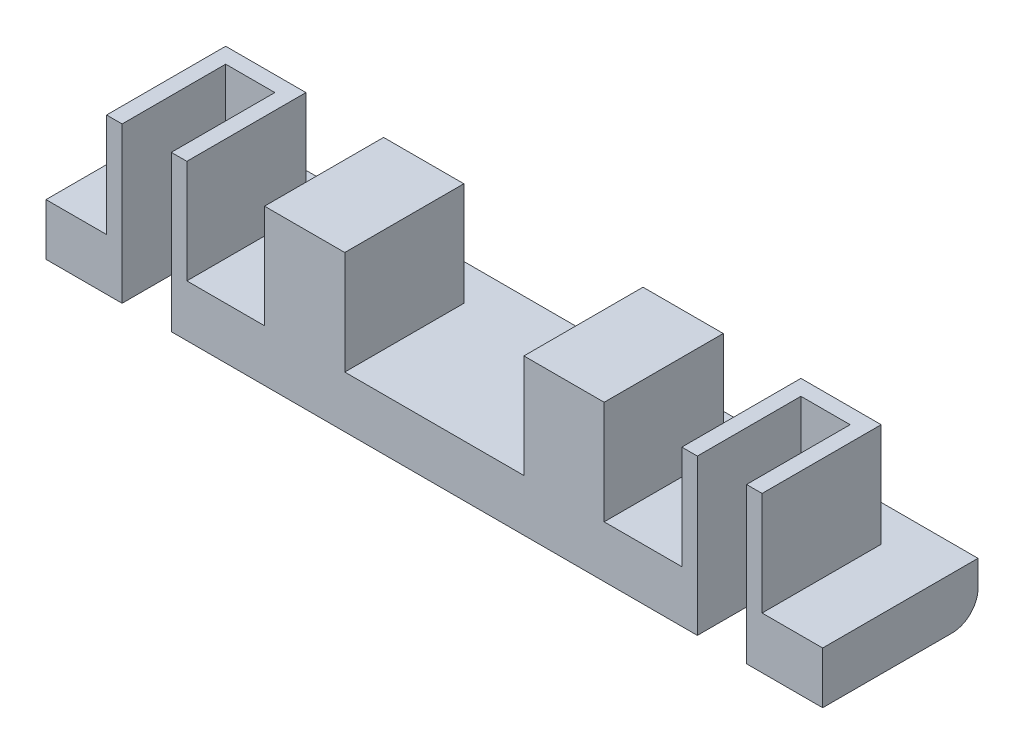
ISO-10303-21;
HEADER;
FILE_DESCRIPTION(('STEP AP214'),'2;1');
FILE_NAME('part.step','',(''),(''),'','','');
FILE_SCHEMA(('AUTOMOTIVE_DESIGN { 1 0 10303 214 1 1 1 1 }'));
ENDSEC;
DATA;
#1=APPLICATION_CONTEXT('core data for automotive mechanical design processes');
#2=APPLICATION_PROTOCOL_DEFINITION('international standard','automotive_design',2000,#1);
#3=PRODUCT_CONTEXT('',#1,'mechanical');
#4=PRODUCT('Part','Part','',(#3));
#5=PRODUCT_RELATED_PRODUCT_CATEGORY('part','',(#4));
#6=PRODUCT_DEFINITION_FORMATION('','',#4);
#7=PRODUCT_DEFINITION_CONTEXT('part definition',#1,'design');
#8=PRODUCT_DEFINITION('design','',#6,#7);
#9=PRODUCT_DEFINITION_SHAPE('','',#8);
#10=(LENGTH_UNIT() NAMED_UNIT(*) SI_UNIT(.MILLI.,.METRE.));
#11=(NAMED_UNIT(*) PLANE_ANGLE_UNIT() SI_UNIT($,.RADIAN.));
#12=(NAMED_UNIT(*) SI_UNIT($,.STERADIAN.) SOLID_ANGLE_UNIT());
#13=UNCERTAINTY_MEASURE_WITH_UNIT(LENGTH_MEASURE(1.E-05),#10,'distance_accuracy_value','');
#14=(GEOMETRIC_REPRESENTATION_CONTEXT(3) GLOBAL_UNCERTAINTY_ASSIGNED_CONTEXT((#13)) GLOBAL_UNIT_ASSIGNED_CONTEXT((#10,
#11,#12)) REPRESENTATION_CONTEXT('',''));
#15=CARTESIAN_POINT('',(0.,0.,0.));
#16=DIRECTION('',(0.,0.,1.));
#17=DIRECTION('',(1.,0.,0.));
#18=AXIS2_PLACEMENT_3D('',#15,#16,#17);
#19=CARTESIAN_POINT('',(0.,10.,0.));
#20=DIRECTION('',(0.,-1.,0.));
#21=DIRECTION('',(0.,0.,-1.));
#22=AXIS2_PLACEMENT_3D('',#19,#20,#21);
#23=PLANE('',#22);
#24=DIRECTION('',(0.,0.,-1.));
#25=VECTOR('',#24,1.);
#26=CARTESIAN_POINT('',(63.3,10.,0.));
#27=LINE('',#26,#25);
#28=CARTESIAN_POINT('',(63.3,10.,15.));
#29=VERTEX_POINT('',#28);
#30=CARTESIAN_POINT('',(63.3,10.,-8.));
#31=VERTEX_POINT('',#30);
#32=EDGE_CURVE('E285',#29,#31,#27,.T.);
#33=ORIENTED_EDGE('',*,*,#32,.F.);
#34=DIRECTION('',(1.,0.,0.));
#35=VECTOR('',#34,1.);
#36=CARTESIAN_POINT('',(-75.,10.,15.));
#37=LINE('',#36,#35);
#38=CARTESIAN_POINT('',(75.,10.,15.));
#39=VERTEX_POINT('',#38);
#40=EDGE_CURVE('E486',#29,#39,#37,.T.);
#41=ORIENTED_EDGE('',*,*,#40,.T.);
#42=DIRECTION('',(0.,0.,-1.));
#43=VECTOR('',#42,1.);
#44=CARTESIAN_POINT('',(75.,10.,15.));
#45=LINE('',#44,#43);
#46=CARTESIAN_POINT('',(75.,10.,-15.));
#47=VERTEX_POINT('',#46);
#48=EDGE_CURVE('E475',#39,#47,#45,.T.);
#49=ORIENTED_EDGE('',*,*,#48,.T.);
#50=DIRECTION('',(-1.,0.,0.));
#51=VECTOR('',#50,1.);
#52=CARTESIAN_POINT('',(-75.,10.,-15.));
#53=LINE('',#52,#51);
#54=CARTESIAN_POINT('',(-75.,10.,-15.));
#55=VERTEX_POINT('',#54);
#56=EDGE_CURVE('E479',#47,#55,#53,.T.);
#57=ORIENTED_EDGE('',*,*,#56,.T.);
#58=DIRECTION('',(0.,0.,1.));
#59=VECTOR('',#58,1.);
#60=CARTESIAN_POINT('',(-75.,10.,15.));
#61=LINE('',#60,#59);
#62=CARTESIAN_POINT('',(-75.,10.,15.));
#63=VERTEX_POINT('',#62);
#64=EDGE_CURVE('E483',#55,#63,#61,.T.);
#65=ORIENTED_EDGE('',*,*,#64,.T.);
#66=CARTESIAN_POINT('',(-63.3,10.,15.));
#67=VERTEX_POINT('',#66);
#68=EDGE_CURVE('E487',#63,#67,#37,.T.);
#69=ORIENTED_EDGE('',*,*,#68,.T.);
#70=DIRECTION('',(0.,0.,-1.));
#71=VECTOR('',#70,1.);
#72=CARTESIAN_POINT('',(-63.3,10.,0.));
#73=LINE('',#72,#71);
#74=CARTESIAN_POINT('',(-63.3,10.,-8.));
#75=VERTEX_POINT('',#74);
#76=EDGE_CURVE('E388',#67,#75,#73,.T.);
#77=ORIENTED_EDGE('',*,*,#76,.T.);
#78=DIRECTION('',(1.,0.,0.));
#79=VECTOR('',#78,1.);
#80=CARTESIAN_POINT('',(0.,10.,-8.));
#81=LINE('',#80,#79);
#82=CARTESIAN_POINT('',(-47.8,10.,-8.));
#83=VERTEX_POINT('',#82);
#84=EDGE_CURVE('E415',#75,#83,#81,.T.);
#85=ORIENTED_EDGE('',*,*,#84,.T.);
#86=DIRECTION('',(0.,0.,-1.));
#87=VECTOR('',#86,1.);
#88=CARTESIAN_POINT('',(-47.8,10.,0.));
#89=LINE('',#88,#87);
#90=CARTESIAN_POINT('',(-47.8,10.,15.));
#91=VERTEX_POINT('',#90);
#92=EDGE_CURVE('E382',#91,#83,#89,.T.);
#93=ORIENTED_EDGE('',*,*,#92,.F.);
#94=CARTESIAN_POINT('',(-32.8,10.,15.));
#95=VERTEX_POINT('',#94);
#96=EDGE_CURVE('E491',#91,#95,#37,.T.);
#97=ORIENTED_EDGE('',*,*,#96,.T.);
#98=DIRECTION('',(0.,0.,-1.));
#99=VECTOR('',#98,1.);
#100=CARTESIAN_POINT('',(-32.8,10.,0.));
#101=LINE('',#100,#99);
#102=CARTESIAN_POINT('',(-32.8,10.,-8.));
#103=VERTEX_POINT('',#102);
#104=EDGE_CURVE('E348',#95,#103,#101,.T.);
#105=ORIENTED_EDGE('',*,*,#104,.T.);
#106=DIRECTION('',(1.,0.,0.));
#107=VECTOR('',#106,1.);
#108=CARTESIAN_POINT('',(0.,10.,-8.));
#109=LINE('',#108,#107);
#110=CARTESIAN_POINT('',(-17.3,10.,-8.));
#111=VERTEX_POINT('',#110);
#112=EDGE_CURVE('E363',#103,#111,#109,.T.);
#113=ORIENTED_EDGE('',*,*,#112,.T.);
#114=DIRECTION('',(0.,0.,-1.));
#115=VECTOR('',#114,1.);
#116=CARTESIAN_POINT('',(-17.3,10.,0.));
#117=LINE('',#116,#115);
#118=CARTESIAN_POINT('',(-17.3,10.,15.));
#119=VERTEX_POINT('',#118);
#120=EDGE_CURVE('E342',#119,#111,#117,.T.);
#121=ORIENTED_EDGE('',*,*,#120,.F.);
#122=CARTESIAN_POINT('',(17.3,10.,15.));
#123=VERTEX_POINT('',#122);
#124=EDGE_CURVE('E525',#119,#123,#37,.T.);
#125=ORIENTED_EDGE('',*,*,#124,.T.);
#126=DIRECTION('',(0.,0.,-1.));
#127=VECTOR('',#126,1.);
#128=CARTESIAN_POINT('',(17.3,10.,0.));
#129=LINE('',#128,#127);
#130=CARTESIAN_POINT('',(17.3,10.,-7.99999999999999));
#131=VERTEX_POINT('',#130);
#132=EDGE_CURVE('E302',#123,#131,#129,.T.);
#133=ORIENTED_EDGE('',*,*,#132,.T.);
#134=DIRECTION('',(-1.,0.,0.));
#135=VECTOR('',#134,1.);
#136=CARTESIAN_POINT('',(0.,10.,-7.99999999999999));
#137=LINE('',#136,#135);
#138=CARTESIAN_POINT('',(32.8,10.,-8.));
#139=VERTEX_POINT('',#138);
#140=EDGE_CURVE('E308',#139,#131,#137,.T.);
#141=ORIENTED_EDGE('',*,*,#140,.F.);
#142=DIRECTION('',(0.,0.,-1.));
#143=VECTOR('',#142,1.);
#144=CARTESIAN_POINT('',(32.8,10.,0.));
#145=LINE('',#144,#143);
#146=CARTESIAN_POINT('',(32.8,10.,15.));
#147=VERTEX_POINT('',#146);
#148=EDGE_CURVE('E320',#147,#139,#145,.T.);
#149=ORIENTED_EDGE('',*,*,#148,.F.);
#150=CARTESIAN_POINT('',(47.8,10.,15.));
#151=VERTEX_POINT('',#150);
#152=EDGE_CURVE('E527',#147,#151,#37,.T.);
#153=ORIENTED_EDGE('',*,*,#152,.T.);
#154=DIRECTION('',(0.,0.,-1.));
#155=VECTOR('',#154,1.);
#156=CARTESIAN_POINT('',(47.8,10.,0.));
#157=LINE('',#156,#155);
#158=CARTESIAN_POINT('',(47.8,10.,-8.));
#159=VERTEX_POINT('',#158);
#160=EDGE_CURVE('E262',#151,#159,#157,.T.);
#161=ORIENTED_EDGE('',*,*,#160,.T.);
#162=DIRECTION('',(-1.,0.,0.));
#163=VECTOR('',#162,1.);
#164=CARTESIAN_POINT('',(0.,10.,-7.99999999999999));
#165=LINE('',#164,#163);
#166=EDGE_CURVE('E266',#31,#159,#165,.T.);
#167=ORIENTED_EDGE('',*,*,#166,.F.);
#168=EDGE_LOOP('',(#33,#41,#49,#57,#65,#69,#77,#85,#93,#97,#105,#113,#121,#125,#133,#141,#149,
#153,#161,#167));
#169=FACE_BOUND('',#168,.T.);
#170=ADVANCED_FACE('F41',(#169),#23,.F.);
#171=CARTESIAN_POINT('',(-75.,10.,15.));
#172=DIRECTION('',(0.,0.,-1.));
#173=DIRECTION('',(-1.,0.,0.));
#174=AXIS2_PLACEMENT_3D('',#171,#172,#173);
#175=PLANE('',#174);
#176=DIRECTION('',(0.,1.,0.));
#177=VECTOR('',#176,1.);
#178=CARTESIAN_POINT('',(-50.8,0.,15.));
#179=LINE('',#178,#177);
#180=CARTESIAN_POINT('',(-50.8,0.,15.));
#181=VERTEX_POINT('',#180);
#182=CARTESIAN_POINT('',(-50.8,30.,15.));
#183=VERTEX_POINT('',#182);
#184=EDGE_CURVE('E445',#181,#183,#179,.T.);
#185=ORIENTED_EDGE('',*,*,#184,.F.);
#186=DIRECTION('',(1.,0.,0.));
#187=VECTOR('',#186,1.);
#188=CARTESIAN_POINT('',(-75.,0.,15.));
#189=LINE('',#188,#187);
#190=CARTESIAN_POINT('',(50.8,0.,15.));
#191=VERTEX_POINT('',#190);
#192=EDGE_CURVE('E501',#181,#191,#189,.T.);
#193=ORIENTED_EDGE('',*,*,#192,.T.);
#194=DIRECTION('',(0.,1.,0.));
#195=VECTOR('',#194,1.);
#196=CARTESIAN_POINT('',(50.8,0.,15.));
#197=LINE('',#196,#195);
#198=CARTESIAN_POINT('',(50.8,30.,15.));
#199=VERTEX_POINT('',#198);
#200=EDGE_CURVE('E244',#191,#199,#197,.T.);
#201=ORIENTED_EDGE('',*,*,#200,.T.);
#202=DIRECTION('',(1.,0.,0.));
#203=VECTOR('',#202,1.);
#204=CARTESIAN_POINT('',(0.,30.,15.));
#205=LINE('',#204,#203);
#206=CARTESIAN_POINT('',(47.8,30.,15.));
#207=VERTEX_POINT('',#206);
#208=EDGE_CURVE('E256',#207,#199,#205,.T.);
#209=ORIENTED_EDGE('',*,*,#208,.F.);
#210=DIRECTION('',(0.,-1.,0.));
#211=VECTOR('',#210,1.);
#212=CARTESIAN_POINT('',(47.8,30.,15.));
#213=LINE('',#212,#211);
#214=EDGE_CURVE('E284',#207,#151,#213,.T.);
#215=ORIENTED_EDGE('',*,*,#214,.T.);
#216=ORIENTED_EDGE('',*,*,#152,.F.);
#217=DIRECTION('',(0.,-1.,0.));
#218=VECTOR('',#217,1.);
#219=CARTESIAN_POINT('',(32.8,30.,15.));
#220=LINE('',#219,#218);
#221=CARTESIAN_POINT('',(32.8,30.,15.));
#222=VERTEX_POINT('',#221);
#223=EDGE_CURVE('E334',#222,#147,#220,.T.);
#224=ORIENTED_EDGE('',*,*,#223,.F.);
#225=DIRECTION('',(1.,0.,0.));
#226=VECTOR('',#225,1.);
#227=CARTESIAN_POINT('',(0.,30.,15.));
#228=LINE('',#227,#226);
#229=CARTESIAN_POINT('',(17.3,30.,15.));
#230=VERTEX_POINT('',#229);
#231=EDGE_CURVE('E307',#230,#222,#228,.T.);
#232=ORIENTED_EDGE('',*,*,#231,.F.);
#233=DIRECTION('',(0.,-1.,0.));
#234=VECTOR('',#233,1.);
#235=CARTESIAN_POINT('',(17.3,30.,15.));
#236=LINE('',#235,#234);
#237=EDGE_CURVE('E338',#230,#123,#236,.T.);
#238=ORIENTED_EDGE('',*,*,#237,.T.);
#239=ORIENTED_EDGE('',*,*,#124,.F.);
#240=DIRECTION('',(0.,-1.,0.));
#241=VECTOR('',#240,1.);
#242=CARTESIAN_POINT('',(-17.3,30.,15.));
#243=LINE('',#242,#241);
#244=CARTESIAN_POINT('',(-17.3,30.,15.));
#245=VERTEX_POINT('',#244);
#246=EDGE_CURVE('E379',#245,#119,#243,.T.);
#247=ORIENTED_EDGE('',*,*,#246,.F.);
#248=DIRECTION('',(1.,0.,0.));
#249=VECTOR('',#248,1.);
#250=CARTESIAN_POINT('',(0.,30.,15.));
#251=LINE('',#250,#249);
#252=CARTESIAN_POINT('',(-32.8,30.,15.));
#253=VERTEX_POINT('',#252);
#254=EDGE_CURVE('E343',#253,#245,#251,.T.);
#255=ORIENTED_EDGE('',*,*,#254,.F.);
#256=DIRECTION('',(0.,-1.,0.));
#257=VECTOR('',#256,1.);
#258=CARTESIAN_POINT('',(-32.8,30.,15.));
#259=LINE('',#258,#257);
#260=EDGE_CURVE('E359',#253,#95,#259,.T.);
#261=ORIENTED_EDGE('',*,*,#260,.T.);
#262=ORIENTED_EDGE('',*,*,#96,.F.);
#263=DIRECTION('',(0.,-1.,0.));
#264=VECTOR('',#263,1.);
#265=CARTESIAN_POINT('',(-47.8,30.,15.));
#266=LINE('',#265,#264);
#267=CARTESIAN_POINT('',(-47.8,30.,15.));
#268=VERTEX_POINT('',#267);
#269=EDGE_CURVE('E431',#268,#91,#266,.T.);
#270=ORIENTED_EDGE('',*,*,#269,.F.);
#271=DIRECTION('',(1.,0.,0.));
#272=VECTOR('',#271,1.);
#273=CARTESIAN_POINT('',(0.,30.,15.));
#274=LINE('',#273,#272);
#275=EDGE_CURVE('E387',#183,#268,#274,.T.);
#276=ORIENTED_EDGE('',*,*,#275,.F.);
#277=EDGE_LOOP('',(#185,#193,#201,#209,#215,#216,#224,#232,#238,#239,#247,#255,#261,#262,#270,#276));
#278=FACE_BOUND('',#277,.T.);
#279=ADVANCED_FACE('F568',(#278),#175,.F.);
#280=DIRECTION('',(0.,1.,0.));
#281=VECTOR('',#280,1.);
#282=CARTESIAN_POINT('',(-60.3,0.,15.));
#283=LINE('',#282,#281);
#284=CARTESIAN_POINT('',(-60.3,0.,15.));
#285=VERTEX_POINT('',#284);
#286=CARTESIAN_POINT('',(-60.3,30.,15.));
#287=VERTEX_POINT('',#286);
#288=EDGE_CURVE('E449',#285,#287,#283,.T.);
#289=ORIENTED_EDGE('',*,*,#288,.T.);
#290=CARTESIAN_POINT('',(-63.3,30.,15.));
#291=VERTEX_POINT('',#290);
#292=EDGE_CURVE('E392',#291,#287,#274,.T.);
#293=ORIENTED_EDGE('',*,*,#292,.F.);
#294=DIRECTION('',(0.,-1.,0.));
#295=VECTOR('',#294,1.);
#296=CARTESIAN_POINT('',(-63.3,30.,15.));
#297=LINE('',#296,#295);
#298=EDGE_CURVE('E411',#291,#67,#297,.T.);
#299=ORIENTED_EDGE('',*,*,#298,.T.);
#300=ORIENTED_EDGE('',*,*,#68,.F.);
#301=DIRECTION('',(0.,-1.,0.));
#302=VECTOR('',#301,1.);
#303=CARTESIAN_POINT('',(-75.,10.,15.));
#304=LINE('',#303,#302);
#305=CARTESIAN_POINT('',(-75.,0.,15.));
#306=VERTEX_POINT('',#305);
#307=EDGE_CURVE('E505',#63,#306,#304,.T.);
#308=ORIENTED_EDGE('',*,*,#307,.T.);
#309=EDGE_CURVE('E480',#306,#285,#189,.T.);
#310=ORIENTED_EDGE('',*,*,#309,.T.);
#311=EDGE_LOOP('',(#289,#293,#299,#300,#308,#310));
#312=FACE_BOUND('',#311,.T.);
#313=ADVANCED_FACE('F626',(#312),#175,.F.);
#314=DIRECTION('',(0.,1.,0.));
#315=VECTOR('',#314,1.);
#316=CARTESIAN_POINT('',(60.3,0.,15.));
#317=LINE('',#316,#315);
#318=CARTESIAN_POINT('',(60.3,0.,15.));
#319=VERTEX_POINT('',#318);
#320=CARTESIAN_POINT('',(60.3,30.,15.));
#321=VERTEX_POINT('',#320);
#322=EDGE_CURVE('E232',#319,#321,#317,.T.);
#323=ORIENTED_EDGE('',*,*,#322,.F.);
#324=CARTESIAN_POINT('',(75.,0.,15.));
#325=VERTEX_POINT('',#324);
#326=EDGE_CURVE('E497',#319,#325,#189,.T.);
#327=ORIENTED_EDGE('',*,*,#326,.T.);
#328=DIRECTION('',(0.,-1.,0.));
#329=VECTOR('',#328,1.);
#330=CARTESIAN_POINT('',(75.,10.,15.));
#331=LINE('',#330,#329);
#332=EDGE_CURVE('E490',#39,#325,#331,.T.);
#333=ORIENTED_EDGE('',*,*,#332,.F.);
#334=ORIENTED_EDGE('',*,*,#40,.F.);
#335=DIRECTION('',(0.,-1.,0.));
#336=VECTOR('',#335,1.);
#337=CARTESIAN_POINT('',(63.3,30.,15.));
#338=LINE('',#337,#336);
#339=CARTESIAN_POINT('',(63.3,30.,15.));
#340=VERTEX_POINT('',#339);
#341=EDGE_CURVE('E250',#340,#29,#338,.T.);
#342=ORIENTED_EDGE('',*,*,#341,.F.);
#343=EDGE_CURVE('E247',#321,#340,#205,.T.);
#344=ORIENTED_EDGE('',*,*,#343,.F.);
#345=EDGE_LOOP('',(#323,#327,#333,#334,#342,#344));
#346=FACE_BOUND('',#345,.T.);
#347=ADVANCED_FACE('F248',(#346),#175,.F.);
#348=CARTESIAN_POINT('',(0.,0.,0.));
#349=DIRECTION('',(0.,-1.,0.));
#350=DIRECTION('',(0.,0.,-1.));
#351=AXIS2_PLACEMENT_3D('',#348,#349,#350);
#352=PLANE('',#351);
#353=DIRECTION('',(0.,0.,1.));
#354=VECTOR('',#353,1.);
#355=CARTESIAN_POINT('',(-75.,0.,15.));
#356=LINE('',#355,#354);
#357=CARTESIAN_POINT('',(-75.,0.,-10.));
#358=VERTEX_POINT('',#357);
#359=EDGE_CURVE('E494',#358,#306,#356,.T.);
#360=ORIENTED_EDGE('',*,*,#359,.F.);
#361=DIRECTION('',(-1.,0.,0.));
#362=VECTOR('',#361,1.);
#363=CARTESIAN_POINT('',(75.,0.,-10.));
#364=LINE('',#363,#362);
#365=CARTESIAN_POINT('',(75.,0.,-10.));
#366=VERTEX_POINT('',#365);
#367=EDGE_CURVE('E50',#358,#366,#364,.F.);
#368=ORIENTED_EDGE('',*,*,#367,.T.);
#369=DIRECTION('',(0.,0.,-1.));
#370=VECTOR('',#369,1.);
#371=CARTESIAN_POINT('',(75.,0.,15.));
#372=LINE('',#371,#370);
#373=EDGE_CURVE('E448',#325,#366,#372,.T.);
#374=ORIENTED_EDGE('',*,*,#373,.F.);
#375=ORIENTED_EDGE('',*,*,#326,.F.);
#376=DIRECTION('',(0.,0.,1.));
#377=VECTOR('',#376,1.);
#378=CARTESIAN_POINT('',(60.3,0.,0.));
#379=LINE('',#378,#377);
#380=CARTESIAN_POINT('',(60.3,0.,-5.));
#381=VERTEX_POINT('',#380);
#382=EDGE_CURVE('E239',#381,#319,#379,.T.);
#383=ORIENTED_EDGE('',*,*,#382,.F.);
#384=DIRECTION('',(-1.,0.,0.));
#385=VECTOR('',#384,1.);
#386=CARTESIAN_POINT('',(0.,0.,-4.99999999999998));
#387=LINE('',#386,#385);
#388=CARTESIAN_POINT('',(50.8,0.,-5.));
#389=VERTEX_POINT('',#388);
#390=EDGE_CURVE('E459',#381,#389,#387,.T.);
#391=ORIENTED_EDGE('',*,*,#390,.T.);
#392=DIRECTION('',(0.,0.,-1.));
#393=VECTOR('',#392,1.);
#394=CARTESIAN_POINT('',(50.8,0.,0.));
#395=LINE('',#394,#393);
#396=EDGE_CURVE('E463',#191,#389,#395,.T.);
#397=ORIENTED_EDGE('',*,*,#396,.F.);
#398=ORIENTED_EDGE('',*,*,#192,.F.);
#399=DIRECTION('',(0.,0.,1.));
#400=VECTOR('',#399,1.);
#401=CARTESIAN_POINT('',(-50.8,0.,0.));
#402=LINE('',#401,#400);
#403=CARTESIAN_POINT('',(-50.8,0.,-5.));
#404=VERTEX_POINT('',#403);
#405=EDGE_CURVE('E243',#404,#181,#402,.T.);
#406=ORIENTED_EDGE('',*,*,#405,.F.);
#407=DIRECTION('',(1.,0.,0.));
#408=VECTOR('',#407,1.);
#409=CARTESIAN_POINT('',(0.,0.,-5.00000000000001));
#410=LINE('',#409,#408);
#411=CARTESIAN_POINT('',(-60.3,0.,-5.));
#412=VERTEX_POINT('',#411);
#413=EDGE_CURVE('E437',#412,#404,#410,.T.);
#414=ORIENTED_EDGE('',*,*,#413,.F.);
#415=DIRECTION('',(0.,0.,-1.));
#416=VECTOR('',#415,1.);
#417=CARTESIAN_POINT('',(-60.3,0.,0.));
#418=LINE('',#417,#416);
#419=EDGE_CURVE('E440',#285,#412,#418,.T.);
#420=ORIENTED_EDGE('',*,*,#419,.F.);
#421=ORIENTED_EDGE('',*,*,#309,.F.);
#422=EDGE_LOOP('',(#360,#368,#374,#375,#383,#391,#397,#398,#406,#414,#420,#421));
#423=FACE_BOUND('',#422,.T.);
#424=ADVANCED_FACE('F546',(#423),#352,.T.);
#425=CARTESIAN_POINT('',(75.,10.,15.));
#426=DIRECTION('',(-1.,0.,0.));
#427=DIRECTION('',(0.,0.,1.));
#428=AXIS2_PLACEMENT_3D('',#425,#426,#427);
#429=PLANE('',#428);
#430=ORIENTED_EDGE('',*,*,#373,.T.);
#431=CARTESIAN_POINT('',(75.,5.,-10.));
#432=DIRECTION('',(-1.,0.,0.));
#433=DIRECTION('',(0.,0.,1.));
#434=AXIS2_PLACEMENT_3D('',#431,#432,#433);
#435=CIRCLE('',#434,5.);
#436=CARTESIAN_POINT('',(75.,5.,-15.));
#437=VERTEX_POINT('',#436);
#438=EDGE_CURVE('E11',#366,#437,#435,.F.);
#439=ORIENTED_EDGE('',*,*,#438,.T.);
#440=DIRECTION('',(0.,-1.,0.));
#441=VECTOR('',#440,1.);
#442=CARTESIAN_POINT('',(75.,10.,-15.));
#443=LINE('',#442,#441);
#444=EDGE_CURVE('E512',#47,#437,#443,.T.);
#445=ORIENTED_EDGE('',*,*,#444,.F.);
#446=ORIENTED_EDGE('',*,*,#48,.F.);
#447=ORIENTED_EDGE('',*,*,#332,.T.);
#448=EDGE_LOOP('',(#430,#439,#445,#446,#447));
#449=FACE_BOUND('',#448,.T.);
#450=ADVANCED_FACE('F550',(#449),#429,.F.);
#451=CARTESIAN_POINT('',(-75.,10.,-15.));
#452=DIRECTION('',(0.,0.,1.));
#453=DIRECTION('',(1.,0.,0.));
#454=AXIS2_PLACEMENT_3D('',#451,#452,#453);
#455=PLANE('',#454);
#456=ORIENTED_EDGE('',*,*,#444,.T.);
#457=DIRECTION('',(-1.,0.,0.));
#458=VECTOR('',#457,1.);
#459=CARTESIAN_POINT('',(-75.,5.,-15.));
#460=LINE('',#459,#458);
#461=CARTESIAN_POINT('',(-75.,5.,-15.));
#462=VERTEX_POINT('',#461);
#463=EDGE_CURVE('E516',#437,#462,#460,.T.);
#464=ORIENTED_EDGE('',*,*,#463,.T.);
#465=DIRECTION('',(0.,-1.,0.));
#466=VECTOR('',#465,1.);
#467=CARTESIAN_POINT('',(-75.,10.,-15.));
#468=LINE('',#467,#466);
#469=EDGE_CURVE('E509',#55,#462,#468,.T.);
#470=ORIENTED_EDGE('',*,*,#469,.F.);
#471=ORIENTED_EDGE('',*,*,#56,.F.);
#472=EDGE_LOOP('',(#456,#464,#470,#471));
#473=FACE_BOUND('',#472,.T.);
#474=ADVANCED_FACE('F634',(#473),#455,.F.);
#475=CARTESIAN_POINT('',(-75.,10.,15.));
#476=DIRECTION('',(1.,0.,0.));
#477=DIRECTION('',(0.,0.,-1.));
#478=AXIS2_PLACEMENT_3D('',#475,#476,#477);
#479=PLANE('',#478);
#480=ORIENTED_EDGE('',*,*,#469,.T.);
#481=CARTESIAN_POINT('',(-75.,5.,-10.));
#482=DIRECTION('',(1.,0.,0.));
#483=DIRECTION('',(0.,0.,-1.));
#484=AXIS2_PLACEMENT_3D('',#481,#482,#483);
#485=CIRCLE('',#484,5.);
#486=EDGE_CURVE('E64',#462,#358,#485,.F.);
#487=ORIENTED_EDGE('',*,*,#486,.T.);
#488=ORIENTED_EDGE('',*,*,#359,.T.);
#489=ORIENTED_EDGE('',*,*,#307,.F.);
#490=ORIENTED_EDGE('',*,*,#64,.F.);
#491=EDGE_LOOP('',(#480,#487,#488,#489,#490));
#492=FACE_BOUND('',#491,.T.);
#493=ADVANCED_FACE('F630',(#492),#479,.F.);
#494=CARTESIAN_POINT('',(60.3,0.,0.));
#495=DIRECTION('',(-1.,0.,0.));
#496=DIRECTION('',(0.,0.,1.));
#497=AXIS2_PLACEMENT_3D('',#494,#495,#496);
#498=PLANE('',#497);
#499=ORIENTED_EDGE('',*,*,#322,.T.);
#500=DIRECTION('',(0.,0.,-1.));
#501=VECTOR('',#500,1.);
#502=CARTESIAN_POINT('',(60.3,30.,0.));
#503=LINE('',#502,#501);
#504=CARTESIAN_POINT('',(60.3,30.,-5.));
#505=VERTEX_POINT('',#504);
#506=EDGE_CURVE('E236',#321,#505,#503,.T.);
#507=ORIENTED_EDGE('',*,*,#506,.T.);
#508=DIRECTION('',(0.,1.,0.));
#509=VECTOR('',#508,1.);
#510=CARTESIAN_POINT('',(60.3,0.,-5.));
#511=LINE('',#510,#509);
#512=EDGE_CURVE('E466',#381,#505,#511,.T.);
#513=ORIENTED_EDGE('',*,*,#512,.F.);
#514=ORIENTED_EDGE('',*,*,#382,.T.);
#515=EDGE_LOOP('',(#499,#507,#513,#514));
#516=FACE_BOUND('',#515,.T.);
#517=ADVANCED_FACE('F234',(#516),#498,.T.);
#518=CARTESIAN_POINT('',(50.8,0.,0.));
#519=DIRECTION('',(1.,0.,0.));
#520=DIRECTION('',(0.,0.,-1.));
#521=AXIS2_PLACEMENT_3D('',#518,#519,#520);
#522=PLANE('',#521);
#523=DIRECTION('',(0.,1.,0.));
#524=VECTOR('',#523,1.);
#525=CARTESIAN_POINT('',(50.8,0.,-5.));
#526=LINE('',#525,#524);
#527=CARTESIAN_POINT('',(50.8,30.,-5.));
#528=VERTEX_POINT('',#527);
#529=EDGE_CURVE('E470',#389,#528,#526,.T.);
#530=ORIENTED_EDGE('',*,*,#529,.T.);
#531=DIRECTION('',(0.,0.,1.));
#532=VECTOR('',#531,1.);
#533=CARTESIAN_POINT('',(50.8,30.,0.));
#534=LINE('',#533,#532);
#535=EDGE_CURVE('E278',#528,#199,#534,.T.);
#536=ORIENTED_EDGE('',*,*,#535,.T.);
#537=ORIENTED_EDGE('',*,*,#200,.F.);
#538=ORIENTED_EDGE('',*,*,#396,.T.);
#539=EDGE_LOOP('',(#530,#536,#537,#538));
#540=FACE_BOUND('',#539,.T.);
#541=ADVANCED_FACE('F541',(#540),#522,.T.);
#542=CARTESIAN_POINT('',(0.,0.,-4.99999999999998));
#543=DIRECTION('',(0.,0.,-1.));
#544=DIRECTION('',(-1.,0.,0.));
#545=AXIS2_PLACEMENT_3D('',#542,#543,#544);
#546=PLANE('',#545);
#547=ORIENTED_EDGE('',*,*,#512,.T.);
#548=DIRECTION('',(-1.,0.,0.));
#549=VECTOR('',#548,1.);
#550=CARTESIAN_POINT('',(0.,30.,-4.99999999999998));
#551=LINE('',#550,#549);
#552=EDGE_CURVE('E260',#505,#528,#551,.T.);
#553=ORIENTED_EDGE('',*,*,#552,.T.);
#554=ORIENTED_EDGE('',*,*,#529,.F.);
#555=ORIENTED_EDGE('',*,*,#390,.F.);
#556=EDGE_LOOP('',(#547,#553,#554,#555));
#557=FACE_BOUND('',#556,.T.);
#558=ADVANCED_FACE('F545',(#557),#546,.F.);
#559=CARTESIAN_POINT('',(-50.8,0.,0.));
#560=DIRECTION('',(-1.,0.,0.));
#561=DIRECTION('',(0.,0.,1.));
#562=AXIS2_PLACEMENT_3D('',#559,#560,#561);
#563=PLANE('',#562);
#564=ORIENTED_EDGE('',*,*,#184,.T.);
#565=DIRECTION('',(0.,0.,-1.));
#566=VECTOR('',#565,1.);
#567=CARTESIAN_POINT('',(-50.8,30.,0.));
#568=LINE('',#567,#566);
#569=CARTESIAN_POINT('',(-50.8,30.,-5.));
#570=VERTEX_POINT('',#569);
#571=EDGE_CURVE('E383',#183,#570,#568,.T.);
#572=ORIENTED_EDGE('',*,*,#571,.T.);
#573=DIRECTION('',(0.,1.,0.));
#574=VECTOR('',#573,1.);
#575=CARTESIAN_POINT('',(-50.8,0.,-5.));
#576=LINE('',#575,#574);
#577=EDGE_CURVE('E444',#404,#570,#576,.T.);
#578=ORIENTED_EDGE('',*,*,#577,.F.);
#579=ORIENTED_EDGE('',*,*,#405,.T.);
#580=EDGE_LOOP('',(#564,#572,#578,#579));
#581=FACE_BOUND('',#580,.T.);
#582=ADVANCED_FACE('F616',(#581),#563,.T.);
#583=CARTESIAN_POINT('',(-60.3,0.,0.));
#584=DIRECTION('',(1.,0.,0.));
#585=DIRECTION('',(0.,0.,-1.));
#586=AXIS2_PLACEMENT_3D('',#583,#584,#585);
#587=PLANE('',#586);
#588=DIRECTION('',(0.,1.,0.));
#589=VECTOR('',#588,1.);
#590=CARTESIAN_POINT('',(-60.3,0.,-5.));
#591=LINE('',#590,#589);
#592=CARTESIAN_POINT('',(-60.3,30.,-5.));
#593=VERTEX_POINT('',#592);
#594=EDGE_CURVE('E452',#412,#593,#591,.T.);
#595=ORIENTED_EDGE('',*,*,#594,.T.);
#596=DIRECTION('',(0.,0.,1.));
#597=VECTOR('',#596,1.);
#598=CARTESIAN_POINT('',(-60.3,30.,0.));
#599=LINE('',#598,#597);
#600=EDGE_CURVE('E403',#593,#287,#599,.T.);
#601=ORIENTED_EDGE('',*,*,#600,.T.);
#602=ORIENTED_EDGE('',*,*,#288,.F.);
#603=ORIENTED_EDGE('',*,*,#419,.T.);
#604=EDGE_LOOP('',(#595,#601,#602,#603));
#605=FACE_BOUND('',#604,.T.);
#606=ADVANCED_FACE('F623',(#605),#587,.T.);
#607=CARTESIAN_POINT('',(0.,0.,-5.00000000000001));
#608=DIRECTION('',(0.,0.,1.));
#609=DIRECTION('',(1.,0.,0.));
#610=AXIS2_PLACEMENT_3D('',#607,#608,#609);
#611=PLANE('',#610);
#612=ORIENTED_EDGE('',*,*,#577,.T.);
#613=DIRECTION('',(1.,0.,0.));
#614=VECTOR('',#613,1.);
#615=CARTESIAN_POINT('',(0.,30.,-5.00000000000001));
#616=LINE('',#615,#614);
#617=EDGE_CURVE('E407',#593,#570,#616,.T.);
#618=ORIENTED_EDGE('',*,*,#617,.F.);
#619=ORIENTED_EDGE('',*,*,#594,.F.);
#620=ORIENTED_EDGE('',*,*,#413,.T.);
#621=EDGE_LOOP('',(#612,#618,#619,#620));
#622=FACE_BOUND('',#621,.T.);
#623=ADVANCED_FACE('F619',(#622),#611,.T.);
#624=CARTESIAN_POINT('',(-47.8,30.,0.));
#625=DIRECTION('',(-1.,0.,0.));
#626=DIRECTION('',(0.,0.,1.));
#627=AXIS2_PLACEMENT_3D('',#624,#625,#626);
#628=PLANE('',#627);
#629=ORIENTED_EDGE('',*,*,#92,.T.);
#630=DIRECTION('',(0.,-1.,0.));
#631=VECTOR('',#630,1.);
#632=CARTESIAN_POINT('',(-47.8,30.,-8.));
#633=LINE('',#632,#631);
#634=CARTESIAN_POINT('',(-47.8,30.,-8.));
#635=VERTEX_POINT('',#634);
#636=EDGE_CURVE('E427',#635,#83,#633,.T.);
#637=ORIENTED_EDGE('',*,*,#636,.F.);
#638=DIRECTION('',(0.,0.,-1.));
#639=VECTOR('',#638,1.);
#640=CARTESIAN_POINT('',(-47.8,30.,0.));
#641=LINE('',#640,#639);
#642=EDGE_CURVE('E391',#268,#635,#641,.T.);
#643=ORIENTED_EDGE('',*,*,#642,.F.);
#644=ORIENTED_EDGE('',*,*,#269,.T.);
#645=EDGE_LOOP('',(#629,#637,#643,#644));
#646=FACE_BOUND('',#645,.T.);
#647=ADVANCED_FACE('F603',(#646),#628,.F.);
#648=CARTESIAN_POINT('',(0.,30.,-8.));
#649=DIRECTION('',(0.,0.,-1.));
#650=DIRECTION('',(-1.,0.,0.));
#651=AXIS2_PLACEMENT_3D('',#648,#649,#650);
#652=PLANE('',#651);
#653=ORIENTED_EDGE('',*,*,#84,.F.);
#654=DIRECTION('',(0.,-1.,0.));
#655=VECTOR('',#654,1.);
#656=CARTESIAN_POINT('',(-63.3,30.,-8.));
#657=LINE('',#656,#655);
#658=CARTESIAN_POINT('',(-63.3,30.,-8.));
#659=VERTEX_POINT('',#658);
#660=EDGE_CURVE('E423',#659,#75,#657,.T.);
#661=ORIENTED_EDGE('',*,*,#660,.F.);
#662=DIRECTION('',(1.,0.,0.));
#663=VECTOR('',#662,1.);
#664=CARTESIAN_POINT('',(0.,30.,-8.));
#665=LINE('',#664,#663);
#666=EDGE_CURVE('E395',#659,#635,#665,.T.);
#667=ORIENTED_EDGE('',*,*,#666,.T.);
#668=ORIENTED_EDGE('',*,*,#636,.T.);
#669=EDGE_LOOP('',(#653,#661,#667,#668));
#670=FACE_BOUND('',#669,.T.);
#671=ADVANCED_FACE('F785',(#670),#652,.T.);
#672=CARTESIAN_POINT('',(-63.3,30.,0.));
#673=DIRECTION('',(-1.,0.,0.));
#674=DIRECTION('',(0.,0.,1.));
#675=AXIS2_PLACEMENT_3D('',#672,#673,#674);
#676=PLANE('',#675);
#677=ORIENTED_EDGE('',*,*,#76,.F.);
#678=ORIENTED_EDGE('',*,*,#298,.F.);
#679=DIRECTION('',(0.,0.,-1.));
#680=VECTOR('',#679,1.);
#681=CARTESIAN_POINT('',(-63.3,30.,0.));
#682=LINE('',#681,#680);
#683=EDGE_CURVE('E399',#291,#659,#682,.T.);
#684=ORIENTED_EDGE('',*,*,#683,.T.);
#685=ORIENTED_EDGE('',*,*,#660,.T.);
#686=EDGE_LOOP('',(#677,#678,#684,#685));
#687=FACE_BOUND('',#686,.T.);
#688=ADVANCED_FACE('F794',(#687),#676,.T.);
#689=CARTESIAN_POINT('',(0.,30.,0.));
#690=DIRECTION('',(0.,1.,0.));
#691=DIRECTION('',(0.,0.,1.));
#692=AXIS2_PLACEMENT_3D('',#689,#690,#691);
#693=PLANE('',#692);
#694=ORIENTED_EDGE('',*,*,#571,.F.);
#695=ORIENTED_EDGE('',*,*,#275,.T.);
#696=ORIENTED_EDGE('',*,*,#642,.T.);
#697=ORIENTED_EDGE('',*,*,#666,.F.);
#698=ORIENTED_EDGE('',*,*,#683,.F.);
#699=ORIENTED_EDGE('',*,*,#292,.T.);
#700=ORIENTED_EDGE('',*,*,#600,.F.);
#701=ORIENTED_EDGE('',*,*,#617,.T.);
#702=EDGE_LOOP('',(#694,#695,#696,#697,#698,#699,#700,#701));
#703=FACE_BOUND('',#702,.T.);
#704=ADVANCED_FACE('F608',(#703),#693,.T.);
#705=CARTESIAN_POINT('',(-17.3,30.,0.));
#706=DIRECTION('',(-1.,0.,0.));
#707=DIRECTION('',(0.,0.,1.));
#708=AXIS2_PLACEMENT_3D('',#705,#706,#707);
#709=PLANE('',#708);
#710=ORIENTED_EDGE('',*,*,#120,.T.);
#711=DIRECTION('',(0.,-1.,0.));
#712=VECTOR('',#711,1.);
#713=CARTESIAN_POINT('',(-17.3,30.,-8.));
#714=LINE('',#713,#712);
#715=CARTESIAN_POINT('',(-17.3,30.,-8.));
#716=VERTEX_POINT('',#715);
#717=EDGE_CURVE('E376',#716,#111,#714,.T.);
#718=ORIENTED_EDGE('',*,*,#717,.F.);
#719=DIRECTION('',(0.,0.,-1.));
#720=VECTOR('',#719,1.);
#721=CARTESIAN_POINT('',(-17.3,30.,0.));
#722=LINE('',#721,#720);
#723=EDGE_CURVE('E347',#245,#716,#722,.T.);
#724=ORIENTED_EDGE('',*,*,#723,.F.);
#725=ORIENTED_EDGE('',*,*,#246,.T.);
#726=EDGE_LOOP('',(#710,#718,#724,#725));
#727=FACE_BOUND('',#726,.T.);
#728=ADVANCED_FACE('F589',(#727),#709,.F.);
#729=CARTESIAN_POINT('',(0.,30.,-8.));
#730=DIRECTION('',(0.,0.,-1.));
#731=DIRECTION('',(-1.,0.,0.));
#732=AXIS2_PLACEMENT_3D('',#729,#730,#731);
#733=PLANE('',#732);
#734=ORIENTED_EDGE('',*,*,#112,.F.);
#735=DIRECTION('',(0.,-1.,0.));
#736=VECTOR('',#735,1.);
#737=CARTESIAN_POINT('',(-32.8,30.,-8.));
#738=LINE('',#737,#736);
#739=CARTESIAN_POINT('',(-32.8,30.,-8.));
#740=VERTEX_POINT('',#739);
#741=EDGE_CURVE('E372',#740,#103,#738,.T.);
#742=ORIENTED_EDGE('',*,*,#741,.F.);
#743=DIRECTION('',(1.,0.,0.));
#744=VECTOR('',#743,1.);
#745=CARTESIAN_POINT('',(0.,30.,-8.));
#746=LINE('',#745,#744);
#747=EDGE_CURVE('E351',#740,#716,#746,.T.);
#748=ORIENTED_EDGE('',*,*,#747,.T.);
#749=ORIENTED_EDGE('',*,*,#717,.T.);
#750=EDGE_LOOP('',(#734,#742,#748,#749));
#751=FACE_BOUND('',#750,.T.);
#752=ADVANCED_FACE('F821',(#751),#733,.T.);
#753=CARTESIAN_POINT('',(-32.8,30.,0.));
#754=DIRECTION('',(-1.,0.,0.));
#755=DIRECTION('',(0.,0.,1.));
#756=AXIS2_PLACEMENT_3D('',#753,#754,#755);
#757=PLANE('',#756);
#758=ORIENTED_EDGE('',*,*,#104,.F.);
#759=ORIENTED_EDGE('',*,*,#260,.F.);
#760=DIRECTION('',(0.,0.,-1.));
#761=VECTOR('',#760,1.);
#762=CARTESIAN_POINT('',(-32.8,30.,0.));
#763=LINE('',#762,#761);
#764=EDGE_CURVE('E355',#253,#740,#763,.T.);
#765=ORIENTED_EDGE('',*,*,#764,.T.);
#766=ORIENTED_EDGE('',*,*,#741,.T.);
#767=EDGE_LOOP('',(#758,#759,#765,#766));
#768=FACE_BOUND('',#767,.T.);
#769=ADVANCED_FACE('F598',(#768),#757,.T.);
#770=CARTESIAN_POINT('',(0.,30.,0.));
#771=DIRECTION('',(0.,1.,0.));
#772=DIRECTION('',(0.,0.,1.));
#773=AXIS2_PLACEMENT_3D('',#770,#771,#772);
#774=PLANE('',#773);
#775=ORIENTED_EDGE('',*,*,#254,.T.);
#776=ORIENTED_EDGE('',*,*,#723,.T.);
#777=ORIENTED_EDGE('',*,*,#747,.F.);
#778=ORIENTED_EDGE('',*,*,#764,.F.);
#779=EDGE_LOOP('',(#775,#776,#777,#778));
#780=FACE_BOUND('',#779,.T.);
#781=ADVANCED_FACE('F596',(#780),#774,.T.);
#782=CARTESIAN_POINT('',(17.3,30.,0.));
#783=DIRECTION('',(-1.,0.,0.));
#784=DIRECTION('',(0.,0.,1.));
#785=AXIS2_PLACEMENT_3D('',#782,#783,#784);
#786=PLANE('',#785);
#787=ORIENTED_EDGE('',*,*,#132,.F.);
#788=ORIENTED_EDGE('',*,*,#237,.F.);
#789=DIRECTION('',(0.,0.,-1.));
#790=VECTOR('',#789,1.);
#791=CARTESIAN_POINT('',(17.3,30.,0.));
#792=LINE('',#791,#790);
#793=CARTESIAN_POINT('',(17.3,30.,-7.99999999999999));
#794=VERTEX_POINT('',#793);
#795=EDGE_CURVE('E303',#230,#794,#792,.T.);
#796=ORIENTED_EDGE('',*,*,#795,.T.);
#797=DIRECTION('',(0.,-1.,0.));
#798=VECTOR('',#797,1.);
#799=CARTESIAN_POINT('',(17.3,30.,-7.99999999999999));
#800=LINE('',#799,#798);
#801=EDGE_CURVE('E317',#794,#131,#800,.T.);
#802=ORIENTED_EDGE('',*,*,#801,.T.);
#803=EDGE_LOOP('',(#787,#788,#796,#802));
#804=FACE_BOUND('',#803,.T.);
#805=ADVANCED_FACE('F585',(#804),#786,.T.);
#806=CARTESIAN_POINT('',(32.8,30.,0.));
#807=DIRECTION('',(-1.,0.,0.));
#808=DIRECTION('',(0.,0.,1.));
#809=AXIS2_PLACEMENT_3D('',#806,#807,#808);
#810=PLANE('',#809);
#811=ORIENTED_EDGE('',*,*,#148,.T.);
#812=DIRECTION('',(0.,-1.,0.));
#813=VECTOR('',#812,1.);
#814=CARTESIAN_POINT('',(32.8,30.,-8.));
#815=LINE('',#814,#813);
#816=CARTESIAN_POINT('',(32.8,30.,-8.));
#817=VERTEX_POINT('',#816);
#818=EDGE_CURVE('E330',#817,#139,#815,.T.);
#819=ORIENTED_EDGE('',*,*,#818,.F.);
#820=DIRECTION('',(0.,0.,-1.));
#821=VECTOR('',#820,1.);
#822=CARTESIAN_POINT('',(32.8,30.,0.));
#823=LINE('',#822,#821);
#824=EDGE_CURVE('E311',#222,#817,#823,.T.);
#825=ORIENTED_EDGE('',*,*,#824,.F.);
#826=ORIENTED_EDGE('',*,*,#223,.T.);
#827=EDGE_LOOP('',(#811,#819,#825,#826));
#828=FACE_BOUND('',#827,.T.);
#829=ADVANCED_FACE('F575',(#828),#810,.F.);
#830=CARTESIAN_POINT('',(0.,30.,-7.99999999999999));
#831=DIRECTION('',(0.,0.,1.));
#832=DIRECTION('',(1.,0.,0.));
#833=AXIS2_PLACEMENT_3D('',#830,#831,#832);
#834=PLANE('',#833);
#835=ORIENTED_EDGE('',*,*,#140,.T.);
#836=ORIENTED_EDGE('',*,*,#801,.F.);
#837=DIRECTION('',(-1.,0.,0.));
#838=VECTOR('',#837,1.);
#839=CARTESIAN_POINT('',(0.,30.,-7.99999999999999));
#840=LINE('',#839,#838);
#841=EDGE_CURVE('E314',#817,#794,#840,.T.);
#842=ORIENTED_EDGE('',*,*,#841,.F.);
#843=ORIENTED_EDGE('',*,*,#818,.T.);
#844=EDGE_LOOP('',(#835,#836,#842,#843));
#845=FACE_BOUND('',#844,.T.);
#846=ADVANCED_FACE('F863',(#845),#834,.F.);
#847=CARTESIAN_POINT('',(0.,30.,0.));
#848=DIRECTION('',(0.,1.,0.));
#849=DIRECTION('',(0.,0.,1.));
#850=AXIS2_PLACEMENT_3D('',#847,#848,#849);
#851=PLANE('',#850);
#852=ORIENTED_EDGE('',*,*,#795,.F.);
#853=ORIENTED_EDGE('',*,*,#231,.T.);
#854=ORIENTED_EDGE('',*,*,#824,.T.);
#855=ORIENTED_EDGE('',*,*,#841,.T.);
#856=EDGE_LOOP('',(#852,#853,#854,#855));
#857=FACE_BOUND('',#856,.T.);
#858=ADVANCED_FACE('F579',(#857),#851,.T.);
#859=CARTESIAN_POINT('',(63.3,30.,0.));
#860=DIRECTION('',(-1.,0.,0.));
#861=DIRECTION('',(0.,0.,1.));
#862=AXIS2_PLACEMENT_3D('',#859,#860,#861);
#863=PLANE('',#862);
#864=ORIENTED_EDGE('',*,*,#32,.T.);
#865=DIRECTION('',(0.,-1.,0.));
#866=VECTOR('',#865,1.);
#867=CARTESIAN_POINT('',(63.3,30.,-8.));
#868=LINE('',#867,#866);
#869=CARTESIAN_POINT('',(63.3,30.,-8.));
#870=VERTEX_POINT('',#869);
#871=EDGE_CURVE('E296',#870,#31,#868,.T.);
#872=ORIENTED_EDGE('',*,*,#871,.F.);
#873=DIRECTION('',(0.,0.,-1.));
#874=VECTOR('',#873,1.);
#875=CARTESIAN_POINT('',(63.3,30.,0.));
#876=LINE('',#875,#874);
#877=EDGE_CURVE('E254',#340,#870,#876,.T.);
#878=ORIENTED_EDGE('',*,*,#877,.F.);
#879=ORIENTED_EDGE('',*,*,#341,.T.);
#880=EDGE_LOOP('',(#864,#872,#878,#879));
#881=FACE_BOUND('',#880,.T.);
#882=ADVANCED_FACE('F559',(#881),#863,.F.);
#883=CARTESIAN_POINT('',(0.,30.,-7.99999999999999));
#884=DIRECTION('',(0.,0.,1.));
#885=DIRECTION('',(1.,0.,0.));
#886=AXIS2_PLACEMENT_3D('',#883,#884,#885);
#887=PLANE('',#886);
#888=ORIENTED_EDGE('',*,*,#166,.T.);
#889=DIRECTION('',(0.,-1.,0.));
#890=VECTOR('',#889,1.);
#891=CARTESIAN_POINT('',(47.8,30.,-8.));
#892=LINE('',#891,#890);
#893=CARTESIAN_POINT('',(47.8,30.,-8.));
#894=VERTEX_POINT('',#893);
#895=EDGE_CURVE('E293',#894,#159,#892,.T.);
#896=ORIENTED_EDGE('',*,*,#895,.F.);
#897=DIRECTION('',(-1.,0.,0.));
#898=VECTOR('',#897,1.);
#899=CARTESIAN_POINT('',(0.,30.,-7.99999999999999));
#900=LINE('',#899,#898);
#901=EDGE_CURVE('E271',#870,#894,#900,.T.);
#902=ORIENTED_EDGE('',*,*,#901,.F.);
#903=ORIENTED_EDGE('',*,*,#871,.T.);
#904=EDGE_LOOP('',(#888,#896,#902,#903));
#905=FACE_BOUND('',#904,.T.);
#906=ADVANCED_FACE('F562',(#905),#887,.F.);
#907=CARTESIAN_POINT('',(47.8,30.,0.));
#908=DIRECTION('',(-1.,0.,0.));
#909=DIRECTION('',(0.,0.,1.));
#910=AXIS2_PLACEMENT_3D('',#907,#908,#909);
#911=PLANE('',#910);
#912=ORIENTED_EDGE('',*,*,#160,.F.);
#913=ORIENTED_EDGE('',*,*,#214,.F.);
#914=DIRECTION('',(0.,0.,-1.));
#915=VECTOR('',#914,1.);
#916=CARTESIAN_POINT('',(47.8,30.,0.));
#917=LINE('',#916,#915);
#918=EDGE_CURVE('E274',#207,#894,#917,.T.);
#919=ORIENTED_EDGE('',*,*,#918,.T.);
#920=ORIENTED_EDGE('',*,*,#895,.T.);
#921=EDGE_LOOP('',(#912,#913,#919,#920));
#922=FACE_BOUND('',#921,.T.);
#923=ADVANCED_FACE('F566',(#922),#911,.T.);
#924=CARTESIAN_POINT('',(0.,30.,0.));
#925=DIRECTION('',(0.,1.,0.));
#926=DIRECTION('',(0.,0.,1.));
#927=AXIS2_PLACEMENT_3D('',#924,#925,#926);
#928=PLANE('',#927);
#929=ORIENTED_EDGE('',*,*,#506,.F.);
#930=ORIENTED_EDGE('',*,*,#343,.T.);
#931=ORIENTED_EDGE('',*,*,#877,.T.);
#932=ORIENTED_EDGE('',*,*,#901,.T.);
#933=ORIENTED_EDGE('',*,*,#918,.F.);
#934=ORIENTED_EDGE('',*,*,#208,.T.);
#935=ORIENTED_EDGE('',*,*,#535,.F.);
#936=ORIENTED_EDGE('',*,*,#552,.F.);
#937=EDGE_LOOP('',(#929,#930,#931,#932,#933,#934,#935,#936));
#938=FACE_BOUND('',#937,.T.);
#939=ADVANCED_FACE('F257',(#938),#928,.T.);
#940=CARTESIAN_POINT('',(-75.,5.,-10.));
#941=DIRECTION('',(1.,0.,0.));
#942=DIRECTION('',(0.,0.,-1.));
#943=AXIS2_PLACEMENT_3D('',#940,#941,#942);
#944=CYLINDRICAL_SURFACE('',#943,5.);
#945=ORIENTED_EDGE('',*,*,#438,.F.);
#946=ORIENTED_EDGE('',*,*,#367,.F.);
#947=ORIENTED_EDGE('',*,*,#486,.F.);
#948=ORIENTED_EDGE('',*,*,#463,.F.);
#949=EDGE_LOOP('',(#945,#946,#947,#948));
#950=FACE_BOUND('',#949,.T.);
#951=ADVANCED_FACE('F43',(#950),#944,.T.);
#952=CLOSED_SHELL('',(#170,#279,#313,#347,#424,#450,#474,#493,#517,#541,#558,#582,#606,#623,
#647,#671,#688,#704,#728,#752,#769,#781,#805,#829,#846,#858,#882,#906,#923,#939,#951));
#953=MANIFOLD_SOLID_BREP('B2',#952);
#954=ADVANCED_BREP_SHAPE_REPRESENTATION('',(#18,#953),#14);
#955=SHAPE_DEFINITION_REPRESENTATION(#9,#954);
ENDSEC;
END-ISO-10303-21;
